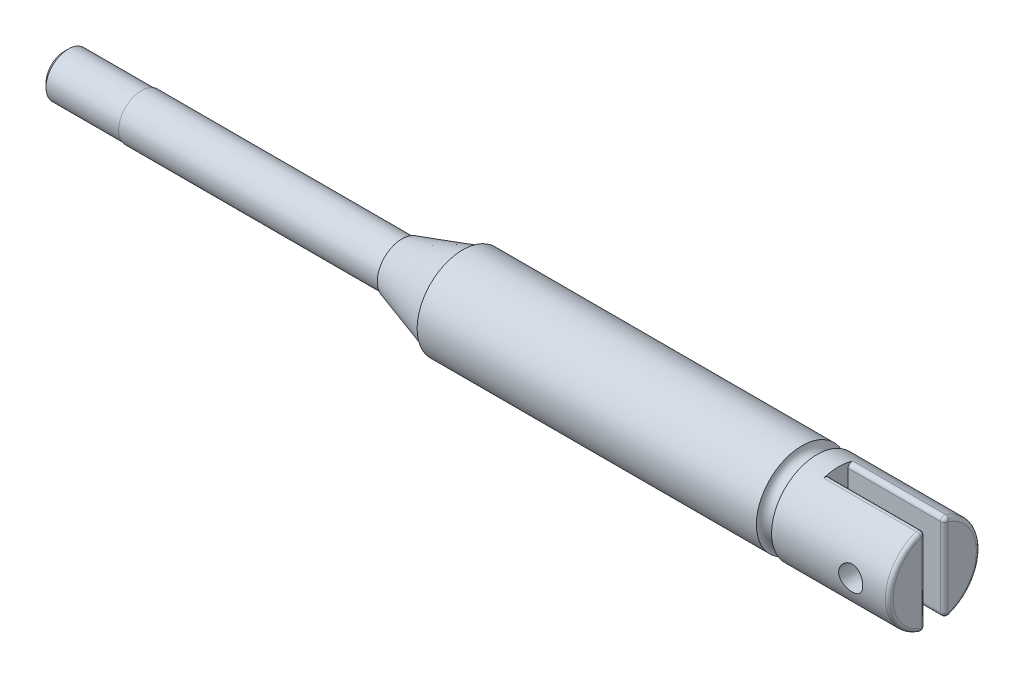
ISO-10303-21;
HEADER;
FILE_DESCRIPTION(('STEP AP214'),'2;1');
FILE_NAME('part.step','',(''),(''),'','','');
FILE_SCHEMA(('AUTOMOTIVE_DESIGN { 1 0 10303 214 1 1 1 1 }'));
ENDSEC;
DATA;
#1=APPLICATION_CONTEXT('core data for automotive mechanical design processes');
#2=APPLICATION_PROTOCOL_DEFINITION('international standard','automotive_design',2000,#1);
#3=PRODUCT_CONTEXT('',#1,'mechanical');
#4=PRODUCT('Part','Part','',(#3));
#5=PRODUCT_RELATED_PRODUCT_CATEGORY('part','',(#4));
#6=PRODUCT_DEFINITION_FORMATION('','',#4);
#7=PRODUCT_DEFINITION_CONTEXT('part definition',#1,'design');
#8=PRODUCT_DEFINITION('design','',#6,#7);
#9=PRODUCT_DEFINITION_SHAPE('','',#8);
#10=(LENGTH_UNIT() NAMED_UNIT(*) SI_UNIT(.MILLI.,.METRE.));
#11=(NAMED_UNIT(*) PLANE_ANGLE_UNIT() SI_UNIT($,.RADIAN.));
#12=(NAMED_UNIT(*) SI_UNIT($,.STERADIAN.) SOLID_ANGLE_UNIT());
#13=UNCERTAINTY_MEASURE_WITH_UNIT(LENGTH_MEASURE(1.E-05),#10,'distance_accuracy_value','');
#14=(GEOMETRIC_REPRESENTATION_CONTEXT(3) GLOBAL_UNCERTAINTY_ASSIGNED_CONTEXT((#13)) GLOBAL_UNIT_ASSIGNED_CONTEXT((#10,
#11,#12)) REPRESENTATION_CONTEXT('',''));
#15=CARTESIAN_POINT('',(0.,0.,0.));
#16=DIRECTION('',(0.,0.,1.));
#17=DIRECTION('',(1.,0.,0.));
#18=AXIS2_PLACEMENT_3D('',#15,#16,#17);
#19=CARTESIAN_POINT('',(-76.0312923411787,0.,0.));
#20=DIRECTION('',(-1.,0.,0.));
#21=DIRECTION('',(0.,-1.,0.));
#22=AXIS2_PLACEMENT_3D('',#19,#20,#21);
#23=CYLINDRICAL_SURFACE('',#22,1.49999999999999);
#24=CARTESIAN_POINT('',(-52.28844,0.,0.));
#25=DIRECTION('',(-1.,0.,0.));
#26=DIRECTION('',(0.,-1.,0.));
#27=AXIS2_PLACEMENT_3D('',#24,#25,#26);
#28=CIRCLE('',#27,1.50000000000001);
#29=CARTESIAN_POINT('',(-52.28844,-1.50000000000001,0.));
#30=VERTEX_POINT('',#29);
#31=EDGE_CURVE('E326',#30,#30,#28,.T.);
#32=ORIENTED_EDGE('',*,*,#31,.F.);
#33=EDGE_LOOP('',(#32));
#34=FACE_BOUND('',#33,.T.);
#35=CARTESIAN_POINT('',(-35.114992,0.,0.));
#36=DIRECTION('',(-1.,0.,0.));
#37=DIRECTION('',(0.,-1.,0.));
#38=AXIS2_PLACEMENT_3D('',#35,#36,#37);
#39=CIRCLE('',#38,1.49999999999999);
#40=CARTESIAN_POINT('',(-35.114992,-1.49999999999998,0.));
#41=VERTEX_POINT('',#40);
#42=EDGE_CURVE('E319',#41,#41,#39,.T.);
#43=ORIENTED_EDGE('',*,*,#42,.T.);
#44=EDGE_LOOP('',(#43));
#45=FACE_BOUND('',#44,.T.);
#46=ADVANCED_FACE('F36',(#34,#45),#23,.T.);
#47=CARTESIAN_POINT('',(-35.114992,1.627,0.));
#48=DIRECTION('',(1.,0.,0.));
#49=DIRECTION('',(0.,1.,0.));
#50=AXIS2_PLACEMENT_3D('',#47,#48,#49);
#51=PLANE('',#50);
#52=ORIENTED_EDGE('',*,*,#42,.F.);
#53=EDGE_LOOP('',(#52));
#54=FACE_BOUND('',#53,.T.);
#55=CARTESIAN_POINT('',(-35.114992,0.,0.));
#56=DIRECTION('',(-1.,0.,0.));
#57=DIRECTION('',(0.,-1.,0.));
#58=AXIS2_PLACEMENT_3D('',#55,#56,#57);
#59=CIRCLE('',#58,1.62699999999999);
#60=CARTESIAN_POINT('',(-35.114992,-1.62699999999998,0.));
#61=VERTEX_POINT('',#60);
#62=EDGE_CURVE('E566',#61,#61,#59,.T.);
#63=ORIENTED_EDGE('',*,*,#62,.T.);
#64=EDGE_LOOP('',(#63));
#65=FACE_BOUND('',#64,.T.);
#66=ADVANCED_FACE('F234',(#54,#65),#51,.F.);
#67=CARTESIAN_POINT('',(-31.115,0.,0.));
#68=DIRECTION('',(1.,0.,0.));
#69=DIRECTION('',(0.,1.,0.));
#70=AXIS2_PLACEMENT_3D('',#67,#68,#69);
#71=CONICAL_SURFACE('',#70,2.87299999999999,0.301974145053179);
#72=ORIENTED_EDGE('',*,*,#62,.F.);
#73=EDGE_LOOP('',(#72));
#74=FACE_BOUND('',#73,.T.);
#75=CARTESIAN_POINT('',(-31.115,0.,0.));
#76=DIRECTION('',(-1.,0.,0.));
#77=DIRECTION('',(0.,-1.,0.));
#78=AXIS2_PLACEMENT_3D('',#75,#76,#77);
#79=CIRCLE('',#78,2.87299999999999);
#80=CARTESIAN_POINT('',(-31.115,-2.87299999999998,0.));
#81=VERTEX_POINT('',#80);
#82=EDGE_CURVE('E561',#81,#81,#79,.T.);
#83=ORIENTED_EDGE('',*,*,#82,.T.);
#84=EDGE_LOOP('',(#83));
#85=FACE_BOUND('',#84,.T.);
#86=ADVANCED_FACE('F240',(#74,#85),#71,.T.);
#87=CARTESIAN_POINT('',(-31.115,3.,0.));
#88=DIRECTION('',(1.,0.,0.));
#89=DIRECTION('',(0.,1.,0.));
#90=AXIS2_PLACEMENT_3D('',#87,#88,#89);
#91=PLANE('',#90);
#92=ORIENTED_EDGE('',*,*,#82,.F.);
#93=EDGE_LOOP('',(#92));
#94=FACE_BOUND('',#93,.T.);
#95=CARTESIAN_POINT('',(-31.115,0.,0.));
#96=DIRECTION('',(-1.,0.,0.));
#97=DIRECTION('',(0.,-1.,0.));
#98=AXIS2_PLACEMENT_3D('',#95,#96,#97);
#99=CIRCLE('',#98,2.99999999999999);
#100=CARTESIAN_POINT('',(-31.115,-2.99999999999998,0.));
#101=VERTEX_POINT('',#100);
#102=EDGE_CURVE('E307',#101,#101,#99,.T.);
#103=ORIENTED_EDGE('',*,*,#102,.T.);
#104=EDGE_LOOP('',(#103));
#105=FACE_BOUND('',#104,.T.);
#106=ADVANCED_FACE('F459',(#94,#105),#91,.F.);
#107=CARTESIAN_POINT('',(-76.0312923411787,0.,0.));
#108=DIRECTION('',(-1.,0.,0.));
#109=DIRECTION('',(0.,-1.,0.));
#110=AXIS2_PLACEMENT_3D('',#107,#108,#109);
#111=CYLINDRICAL_SURFACE('',#110,2.99999999999999);
#112=CARTESIAN_POINT('',(-8.755,0.,0.));
#113=DIRECTION('',(1.,0.,0.));
#114=DIRECTION('',(0.,1.,0.));
#115=AXIS2_PLACEMENT_3D('',#112,#113,#114);
#116=CIRCLE('',#115,2.99999999999999);
#117=CARTESIAN_POINT('',(-8.755,3.,0.));
#118=VERTEX_POINT('',#117);
#119=EDGE_CURVE('E208',#118,#118,#116,.F.);
#120=ORIENTED_EDGE('',*,*,#119,.T.);
#121=EDGE_LOOP('',(#120));
#122=FACE_BOUND('',#121,.T.);
#123=ORIENTED_EDGE('',*,*,#102,.F.);
#124=EDGE_LOOP('',(#123));
#125=FACE_BOUND('',#124,.T.);
#126=ADVANCED_FACE('F335',(#122,#125),#111,.T.);
#127=CARTESIAN_POINT('',(-63.4330682425012,0.,0.));
#128=DIRECTION('',(-1.,0.,0.));
#129=DIRECTION('',(0.,-1.,0.));
#130=AXIS2_PLACEMENT_3D('',#127,#128,#129);
#131=CYLINDRICAL_SURFACE('',#130,1.4605);
#132=CARTESIAN_POINT('',(-57.11444,0.,0.));
#133=DIRECTION('',(1.,0.,0.));
#134=DIRECTION('',(0.,1.,0.));
#135=AXIS2_PLACEMENT_3D('',#132,#133,#134);
#136=CIRCLE('',#135,1.4605);
#137=CARTESIAN_POINT('',(-57.11444,1.4605,0.));
#138=VERTEX_POINT('',#137);
#139=EDGE_CURVE('E147',#138,#138,#136,.T.);
#140=ORIENTED_EDGE('',*,*,#139,.T.);
#141=EDGE_LOOP('',(#140));
#142=FACE_BOUND('',#141,.T.);
#143=CARTESIAN_POINT('',(-52.28844,0.,0.));
#144=DIRECTION('',(-1.,0.,0.));
#145=DIRECTION('',(0.,-1.,0.));
#146=AXIS2_PLACEMENT_3D('',#143,#144,#145);
#147=CIRCLE('',#146,1.4605);
#148=CARTESIAN_POINT('',(-52.28844,-1.4605,0.));
#149=VERTEX_POINT('',#148);
#150=EDGE_CURVE('E195',#149,#149,#147,.T.);
#151=ORIENTED_EDGE('',*,*,#150,.T.);
#152=EDGE_LOOP('',(#151));
#153=FACE_BOUND('',#152,.T.);
#154=ADVANCED_FACE('F330',(#142,#153),#131,.T.);
#155=CARTESIAN_POINT('',(-52.28844,1.50000000000001,0.));
#156=DIRECTION('',(1.,0.,0.));
#157=DIRECTION('',(0.,1.,0.));
#158=AXIS2_PLACEMENT_3D('',#155,#156,#157);
#159=PLANE('',#158);
#160=ORIENTED_EDGE('',*,*,#150,.F.);
#161=EDGE_LOOP('',(#160));
#162=FACE_BOUND('',#161,.T.);
#163=ORIENTED_EDGE('',*,*,#31,.T.);
#164=EDGE_LOOP('',(#163));
#165=FACE_BOUND('',#164,.T.);
#166=ADVANCED_FACE('F248',(#162,#165),#159,.F.);
#167=CARTESIAN_POINT('',(-57.36844,0.,0.));
#168=DIRECTION('',(1.,0.,0.));
#169=DIRECTION('',(0.,1.,0.));
#170=AXIS2_PLACEMENT_3D('',#167,#168,#169);
#171=PLANE('',#170);
#172=CARTESIAN_POINT('',(-57.36844,0.,0.));
#173=DIRECTION('',(1.,0.,0.));
#174=DIRECTION('',(0.,1.,0.));
#175=AXIS2_PLACEMENT_3D('',#172,#173,#174);
#176=CIRCLE('',#175,1.20649999999999);
#177=CARTESIAN_POINT('',(-57.36844,1.20649999999999,0.));
#178=VERTEX_POINT('',#177);
#179=EDGE_CURVE('E314',#178,#178,#176,.F.);
#180=ORIENTED_EDGE('',*,*,#179,.T.);
#181=EDGE_LOOP('',(#180));
#182=FACE_BOUND('',#181,.T.);
#183=ADVANCED_FACE('F229',(#182),#171,.F.);
#184=CARTESIAN_POINT('',(-57.36844,0.,0.));
#185=DIRECTION('',(1.,0.,0.));
#186=DIRECTION('',(0.,1.,0.));
#187=AXIS2_PLACEMENT_3D('',#184,#185,#186);
#188=CONICAL_SURFACE('',#187,1.20649999999999,0.785398163397466);
#189=ORIENTED_EDGE('',*,*,#139,.F.);
#190=EDGE_LOOP('',(#189));
#191=FACE_BOUND('',#190,.T.);
#192=ORIENTED_EDGE('',*,*,#179,.F.);
#193=EDGE_LOOP('',(#192));
#194=FACE_BOUND('',#193,.T.);
#195=ADVANCED_FACE('F221',(#191,#194),#188,.T.);
#196=CARTESIAN_POINT('',(-8.255,0.,0.));
#197=DIRECTION('',(1.,0.,0.));
#198=DIRECTION('',(0.,1.,0.));
#199=AXIS2_PLACEMENT_3D('',#196,#197,#198);
#200=TOROIDAL_SURFACE('',#199,2.99999999999999,0.500000000000001);
#201=ORIENTED_EDGE('',*,*,#119,.F.);
#202=EDGE_LOOP('',(#201));
#203=FACE_BOUND('',#202,.T.);
#204=CARTESIAN_POINT('',(-7.755,0.,0.));
#205=DIRECTION('',(-1.,0.,0.));
#206=DIRECTION('',(0.,-1.,0.));
#207=AXIS2_PLACEMENT_3D('',#204,#205,#206);
#208=CIRCLE('',#207,2.99999999999999);
#209=CARTESIAN_POINT('',(-7.755,-2.99999999999997,0.));
#210=VERTEX_POINT('',#209);
#211=EDGE_CURVE('E40',#210,#210,#208,.F.);
#212=ORIENTED_EDGE('',*,*,#211,.F.);
#213=EDGE_LOOP('',(#212));
#214=FACE_BOUND('',#213,.T.);
#215=ADVANCED_FACE('F218',(#203,#214),#200,.F.);
#216=CARTESIAN_POINT('',(-0.254,0.,0.889));
#217=DIRECTION('',(0.,1.,0.));
#218=DIRECTION('',(-1.,0.,0.));
#219=AXIS2_PLACEMENT_3D('',#216,#217,#218);
#220=CYLINDRICAL_SURFACE('',#219,0.254);
#221=CARTESIAN_POINT('',(-0.253999999999999,-2.59811373884976,0.889));
#222=DIRECTION('',(0.,-1.,0.));
#223=DIRECTION('',(1.,0.,0.));
#224=AXIS2_PLACEMENT_3D('',#221,#222,#223);
#225=CIRCLE('',#224,0.254);
#226=CARTESIAN_POINT('',(0.,-2.59811373884976,0.889));
#227=VERTEX_POINT('',#226);
#228=CARTESIAN_POINT('',(-0.253999999999999,-2.59811373884976,0.635));
#229=VERTEX_POINT('',#228);
#230=EDGE_CURVE('E53',#227,#229,#225,.F.);
#231=ORIENTED_EDGE('',*,*,#230,.T.);
#232=DIRECTION('',(0.,1.,0.));
#233=VECTOR('',#232,1.);
#234=CARTESIAN_POINT('',(-0.253999999999999,-2.99999999999998,0.635));
#235=LINE('',#234,#233);
#236=CARTESIAN_POINT('',(-0.254,2.59811373884978,0.635));
#237=VERTEX_POINT('',#236);
#238=EDGE_CURVE('E178',#237,#229,#235,.F.);
#239=ORIENTED_EDGE('',*,*,#238,.F.);
#240=CARTESIAN_POINT('',(-0.254,2.59811373884978,0.889));
#241=DIRECTION('',(0.,1.,0.));
#242=DIRECTION('',(0.,0.,1.));
#243=AXIS2_PLACEMENT_3D('',#240,#241,#242);
#244=CIRCLE('',#243,0.254);
#245=CARTESIAN_POINT('',(0.,2.59811373884978,0.889));
#246=VERTEX_POINT('',#245);
#247=EDGE_CURVE('E196',#237,#246,#244,.F.);
#248=ORIENTED_EDGE('',*,*,#247,.T.);
#249=DIRECTION('',(0.,1.,0.));
#250=VECTOR('',#249,1.);
#251=CARTESIAN_POINT('',(0.,0.,0.889));
#252=LINE('',#251,#250);
#253=EDGE_CURVE('E174',#227,#246,#252,.T.);
#254=ORIENTED_EDGE('',*,*,#253,.F.);
#255=EDGE_LOOP('',(#231,#239,#248,#254));
#256=FACE_BOUND('',#255,.T.);
#257=ADVANCED_FACE('F220',(#256),#220,.T.);
#258=CARTESIAN_POINT('',(-0.254,0.,-0.889));
#259=DIRECTION('',(0.,-1.,0.));
#260=DIRECTION('',(1.,0.,0.));
#261=AXIS2_PLACEMENT_3D('',#258,#259,#260);
#262=CYLINDRICAL_SURFACE('',#261,0.254);
#263=CARTESIAN_POINT('',(-0.254,2.59811373884978,-0.889));
#264=DIRECTION('',(0.,1.,0.));
#265=DIRECTION('',(-1.,0.,0.));
#266=AXIS2_PLACEMENT_3D('',#263,#264,#265);
#267=CIRCLE('',#266,0.254);
#268=CARTESIAN_POINT('',(0.,2.59811373884978,-0.889));
#269=VERTEX_POINT('',#268);
#270=CARTESIAN_POINT('',(-0.254,2.59811373884978,-0.635));
#271=VERTEX_POINT('',#270);
#272=EDGE_CURVE('E128',#269,#271,#267,.F.);
#273=ORIENTED_EDGE('',*,*,#272,.T.);
#274=DIRECTION('',(0.,-1.,0.));
#275=VECTOR('',#274,1.);
#276=CARTESIAN_POINT('',(-0.253999999999999,-2.99999999999998,-0.635));
#277=LINE('',#276,#275);
#278=CARTESIAN_POINT('',(-0.253999999999999,-2.59811373884976,-0.635));
#279=VERTEX_POINT('',#278);
#280=EDGE_CURVE('E125',#279,#271,#277,.F.);
#281=ORIENTED_EDGE('',*,*,#280,.F.);
#282=CARTESIAN_POINT('',(-0.253999999999999,-2.59811373884976,-0.889));
#283=DIRECTION('',(0.,-1.,0.));
#284=DIRECTION('',(0.,0.,-1.));
#285=AXIS2_PLACEMENT_3D('',#282,#283,#284);
#286=CIRCLE('',#285,0.254);
#287=CARTESIAN_POINT('',(0.,-2.59811373884976,-0.889));
#288=VERTEX_POINT('',#287);
#289=EDGE_CURVE('E119',#279,#288,#286,.F.);
#290=ORIENTED_EDGE('',*,*,#289,.T.);
#291=DIRECTION('',(0.,-1.,0.));
#292=VECTOR('',#291,1.);
#293=CARTESIAN_POINT('',(0.,0.,-0.889));
#294=LINE('',#293,#292);
#295=EDGE_CURVE('E123',#269,#288,#294,.T.);
#296=ORIENTED_EDGE('',*,*,#295,.F.);
#297=EDGE_LOOP('',(#273,#281,#290,#296));
#298=FACE_BOUND('',#297,.T.);
#299=ADVANCED_FACE('F121',(#298),#262,.T.);
#300=CARTESIAN_POINT('',(0.,0.,0.));
#301=DIRECTION('',(-1.,0.,0.));
#302=DIRECTION('',(0.,-1.,0.));
#303=AXIS2_PLACEMENT_3D('',#300,#301,#302);
#304=PLANE('',#303);
#305=CARTESIAN_POINT('',(0.,0.,0.));
#306=DIRECTION('',(-1.,0.,0.));
#307=DIRECTION('',(0.,-1.,0.));
#308=AXIS2_PLACEMENT_3D('',#305,#306,#307);
#309=CIRCLE('',#308,2.74599999999999);
#310=EDGE_CURVE('E142',#288,#269,#309,.F.);
#311=ORIENTED_EDGE('',*,*,#310,.T.);
#312=ORIENTED_EDGE('',*,*,#295,.T.);
#313=EDGE_LOOP('',(#311,#312));
#314=FACE_BOUND('',#313,.T.);
#315=ADVANCED_FACE('F149',(#314),#304,.F.);
#316=CARTESIAN_POINT('',(-0.254,2.59811373884978,-0.889));
#317=DIRECTION('',(0.,0.,1.));
#318=DIRECTION('',(1.,0.,0.));
#319=AXIS2_PLACEMENT_3D('',#316,#317,#318);
#320=SPHERICAL_SURFACE('',#319,0.254);
#321=CARTESIAN_POINT('',(-0.254,2.59811373884978,-0.889));
#322=DIRECTION('',(0.,0.323743627093956,0.946144842989724));
#323=DIRECTION('',(0.,-0.946144842989724,0.323743627093956));
#324=AXIS2_PLACEMENT_3D('',#321,#322,#323);
#325=CIRCLE('',#324,0.254);
#326=CARTESIAN_POINT('',(-0.254000000000005,2.83843452896917,-0.971230881281865));
#327=VERTEX_POINT('',#326);
#328=EDGE_CURVE('E139',#269,#327,#325,.T.);
#329=ORIENTED_EDGE('',*,*,#328,.T.);
#330=CARTESIAN_POINT('',(-0.254000000000005,2.59811373884978,-0.889));
#331=DIRECTION('',(1.,0.,0.));
#332=DIRECTION('',(0.,0.,-1.));
#333=AXIS2_PLACEMENT_3D('',#330,#331,#332);
#334=CIRCLE('',#333,0.254);
#335=EDGE_CURVE('E192',#327,#271,#334,.T.);
#336=ORIENTED_EDGE('',*,*,#335,.T.);
#337=ORIENTED_EDGE('',*,*,#272,.F.);
#338=EDGE_LOOP('',(#329,#336,#337));
#339=FACE_BOUND('',#338,.T.);
#340=ADVANCED_FACE('F257',(#339),#320,.T.);
#341=CARTESIAN_POINT('',(0.,0.,0.));
#342=DIRECTION('',(-1.,0.,0.));
#343=DIRECTION('',(0.,-1.,0.));
#344=AXIS2_PLACEMENT_3D('',#341,#342,#343);
#345=CIRCLE('',#344,2.74599999999999);
#346=EDGE_CURVE('E172',#246,#227,#345,.F.);
#347=ORIENTED_EDGE('',*,*,#346,.T.);
#348=ORIENTED_EDGE('',*,*,#253,.T.);
#349=EDGE_LOOP('',(#347,#348));
#350=FACE_BOUND('',#349,.T.);
#351=ADVANCED_FACE('F260',(#350),#304,.F.);
#352=CARTESIAN_POINT('',(-0.254,2.59811373884978,0.889));
#353=DIRECTION('',(0.,0.,1.));
#354=DIRECTION('',(1.,0.,0.));
#355=AXIS2_PLACEMENT_3D('',#352,#353,#354);
#356=SPHERICAL_SURFACE('',#355,0.254);
#357=CARTESIAN_POINT('',(-0.254,2.59811373884978,0.889));
#358=DIRECTION('',(1.,0.,0.));
#359=DIRECTION('',(0.,1.,0.));
#360=AXIS2_PLACEMENT_3D('',#357,#358,#359);
#361=CIRCLE('',#360,0.254);
#362=CARTESIAN_POINT('',(-0.254000000000005,2.83843452896917,0.971230881281865));
#363=VERTEX_POINT('',#362);
#364=EDGE_CURVE('E199',#237,#363,#361,.T.);
#365=ORIENTED_EDGE('',*,*,#364,.T.);
#366=CARTESIAN_POINT('',(-0.254000000000005,2.59811373884978,0.889));
#367=DIRECTION('',(0.,0.323743627093956,-0.946144842989724));
#368=DIRECTION('',(0.,0.946144842989724,0.323743627093956));
#369=AXIS2_PLACEMENT_3D('',#366,#367,#368);
#370=CIRCLE('',#369,0.254);
#371=EDGE_CURVE('E202',#363,#246,#370,.T.);
#372=ORIENTED_EDGE('',*,*,#371,.T.);
#373=ORIENTED_EDGE('',*,*,#247,.F.);
#374=EDGE_LOOP('',(#365,#372,#373));
#375=FACE_BOUND('',#374,.T.);
#376=ADVANCED_FACE('F275',(#375),#356,.T.);
#377=CARTESIAN_POINT('',(-0.253999999999999,-2.59811373884976,0.889));
#378=DIRECTION('',(0.,0.,1.));
#379=DIRECTION('',(1.,0.,0.));
#380=AXIS2_PLACEMENT_3D('',#377,#378,#379);
#381=SPHERICAL_SURFACE('',#380,0.254);
#382=CARTESIAN_POINT('',(-0.253999999999999,-2.59811373884976,0.889));
#383=DIRECTION('',(0.,-0.323743627093956,-0.946144842989724));
#384=DIRECTION('',(0.,0.946144842989724,-0.323743627093956));
#385=AXIS2_PLACEMENT_3D('',#382,#383,#384);
#386=CIRCLE('',#385,0.254);
#387=CARTESIAN_POINT('',(-0.254000000000004,-2.83843452896915,0.971230881281865));
#388=VERTEX_POINT('',#387);
#389=EDGE_CURVE('E205',#227,#388,#386,.T.);
#390=ORIENTED_EDGE('',*,*,#389,.T.);
#391=CARTESIAN_POINT('',(-0.254000000000004,-2.59811373884976,0.889));
#392=DIRECTION('',(1.,0.,0.));
#393=DIRECTION('',(0.,0.,-1.));
#394=AXIS2_PLACEMENT_3D('',#391,#392,#393);
#395=CIRCLE('',#394,0.254);
#396=EDGE_CURVE('E129',#388,#229,#395,.T.);
#397=ORIENTED_EDGE('',*,*,#396,.T.);
#398=ORIENTED_EDGE('',*,*,#230,.F.);
#399=EDGE_LOOP('',(#390,#397,#398));
#400=FACE_BOUND('',#399,.T.);
#401=ADVANCED_FACE('F278',(#400),#381,.T.);
#402=CARTESIAN_POINT('',(-6.35,-2.99999999999998,0.635));
#403=DIRECTION('',(0.,0.,1.));
#404=DIRECTION('',(1.,0.,0.));
#405=AXIS2_PLACEMENT_3D('',#402,#403,#404);
#406=PLANE('',#405);
#407=CARTESIAN_POINT('',(-2.54,0.,0.635));
#408=DIRECTION('',(0.,0.,1.));
#409=DIRECTION('',(1.,0.,0.));
#410=AXIS2_PLACEMENT_3D('',#407,#408,#409);
#411=CIRCLE('',#410,0.79375);
#412=CARTESIAN_POINT('',(-1.74625,0.,0.635));
#413=VERTEX_POINT('',#412);
#414=EDGE_CURVE('E325',#413,#413,#411,.T.);
#415=ORIENTED_EDGE('',*,*,#414,.T.);
#416=EDGE_LOOP('',(#415));
#417=FACE_BOUND('',#416,.T.);
#418=ORIENTED_EDGE('',*,*,#238,.T.);
#419=DIRECTION('',(-1.,0.,0.));
#420=VECTOR('',#419,1.);
#421=CARTESIAN_POINT('',(-6.35,-2.59811373884976,0.635));
#422=LINE('',#421,#420);
#423=CARTESIAN_POINT('',(-6.35,-2.59811373884976,0.635));
#424=VERTEX_POINT('',#423);
#425=EDGE_CURVE('E180',#229,#424,#422,.T.);
#426=ORIENTED_EDGE('',*,*,#425,.T.);
#427=DIRECTION('',(0.,1.,0.));
#428=VECTOR('',#427,1.);
#429=CARTESIAN_POINT('',(-6.35,-2.99999999999998,0.635));
#430=LINE('',#429,#428);
#431=CARTESIAN_POINT('',(-6.35,2.59811373884978,0.635));
#432=VERTEX_POINT('',#431);
#433=EDGE_CURVE('E303',#424,#432,#430,.T.);
#434=ORIENTED_EDGE('',*,*,#433,.T.);
#435=DIRECTION('',(-1.,0.,0.));
#436=VECTOR('',#435,1.);
#437=CARTESIAN_POINT('',(-6.35,2.59811373884978,0.635));
#438=LINE('',#437,#436);
#439=EDGE_CURVE('E61',#432,#237,#438,.F.);
#440=ORIENTED_EDGE('',*,*,#439,.T.);
#441=EDGE_LOOP('',(#418,#426,#434,#440));
#442=FACE_BOUND('',#441,.T.);
#443=ADVANCED_FACE('F282',(#417,#442),#406,.F.);
#444=CARTESIAN_POINT('',(-6.35,-2.99999999999998,-0.635));
#445=DIRECTION('',(0.,0.,-1.));
#446=DIRECTION('',(-1.,0.,0.));
#447=AXIS2_PLACEMENT_3D('',#444,#445,#446);
#448=PLANE('',#447);
#449=CARTESIAN_POINT('',(-2.54,0.,-0.635));
#450=DIRECTION('',(0.,0.,-1.));
#451=DIRECTION('',(-1.,0.,0.));
#452=AXIS2_PLACEMENT_3D('',#449,#450,#451);
#453=CIRCLE('',#452,0.79375);
#454=CARTESIAN_POINT('',(-3.33375,0.,-0.635));
#455=VERTEX_POINT('',#454);
#456=EDGE_CURVE('E323',#455,#455,#453,.T.);
#457=ORIENTED_EDGE('',*,*,#456,.T.);
#458=EDGE_LOOP('',(#457));
#459=FACE_BOUND('',#458,.T.);
#460=DIRECTION('',(0.,1.,0.));
#461=VECTOR('',#460,1.);
#462=CARTESIAN_POINT('',(-6.35,-2.99999999999998,-0.635));
#463=LINE('',#462,#461);
#464=CARTESIAN_POINT('',(-6.35,-2.59811373884976,-0.635));
#465=VERTEX_POINT('',#464);
#466=CARTESIAN_POINT('',(-6.35,2.59811373884978,-0.635));
#467=VERTEX_POINT('',#466);
#468=EDGE_CURVE('E308',#465,#467,#463,.T.);
#469=ORIENTED_EDGE('',*,*,#468,.F.);
#470=DIRECTION('',(-1.,0.,0.));
#471=VECTOR('',#470,1.);
#472=CARTESIAN_POINT('',(-6.35,-2.59811373884976,-0.635));
#473=LINE('',#472,#471);
#474=EDGE_CURVE('E156',#465,#279,#473,.F.);
#475=ORIENTED_EDGE('',*,*,#474,.T.);
#476=ORIENTED_EDGE('',*,*,#280,.T.);
#477=DIRECTION('',(-1.,0.,0.));
#478=VECTOR('',#477,1.);
#479=CARTESIAN_POINT('',(-6.35,2.59811373884978,-0.635));
#480=LINE('',#479,#478);
#481=EDGE_CURVE('E150',#271,#467,#480,.T.);
#482=ORIENTED_EDGE('',*,*,#481,.T.);
#483=EDGE_LOOP('',(#469,#475,#476,#482));
#484=FACE_BOUND('',#483,.T.);
#485=ADVANCED_FACE('F256',(#459,#484),#448,.F.);
#486=CARTESIAN_POINT('',(-0.253999999999999,-2.59811373884976,-0.889));
#487=DIRECTION('',(0.,0.,1.));
#488=DIRECTION('',(1.,0.,0.));
#489=AXIS2_PLACEMENT_3D('',#486,#487,#488);
#490=SPHERICAL_SURFACE('',#489,0.254);
#491=CARTESIAN_POINT('',(-0.253999999999999,-2.59811373884976,-0.889));
#492=DIRECTION('',(1.,0.,0.));
#493=DIRECTION('',(0.,1.,0.));
#494=AXIS2_PLACEMENT_3D('',#491,#492,#493);
#495=CIRCLE('',#494,0.254);
#496=CARTESIAN_POINT('',(-0.254000000000004,-2.83843452896915,-0.971230881281865));
#497=VERTEX_POINT('',#496);
#498=EDGE_CURVE('E136',#279,#497,#495,.T.);
#499=ORIENTED_EDGE('',*,*,#498,.T.);
#500=CARTESIAN_POINT('',(-0.254000000000004,-2.59811373884976,-0.889));
#501=DIRECTION('',(0.,-0.323743627093957,0.946144842989724));
#502=DIRECTION('',(0.,-0.946144842989724,-0.323743627093957));
#503=AXIS2_PLACEMENT_3D('',#500,#501,#502);
#504=CIRCLE('',#503,0.254);
#505=EDGE_CURVE('E132',#497,#288,#504,.T.);
#506=ORIENTED_EDGE('',*,*,#505,.T.);
#507=ORIENTED_EDGE('',*,*,#289,.F.);
#508=EDGE_LOOP('',(#499,#506,#507));
#509=FACE_BOUND('',#508,.T.);
#510=ADVANCED_FACE('F134',(#509),#490,.T.);
#511=CARTESIAN_POINT('',(-2.54,0.,-2.99999999999999));
#512=DIRECTION('',(0.,0.,1.));
#513=DIRECTION('',(1.,0.,0.));
#514=AXIS2_PLACEMENT_3D('',#511,#512,#513);
#515=CYLINDRICAL_SURFACE('',#514,0.79375);
#516=ORIENTED_EDGE('',*,*,#456,.F.);
#517=EDGE_LOOP('',(#516));
#518=FACE_BOUND('',#517,.T.);
#519=CARTESIAN_POINT('',(-1.74625,0.,-2.99999999999999));
#520=CARTESIAN_POINT('',(-1.74625106466458,0.0437698375668157,-2.9999993282264));
#521=CARTESIAN_POINT('',(-1.74988254999377,0.0875511439939445,-2.99903265897856));
#522=CARTESIAN_POINT('',(-1.76428734018329,0.17385336792853,-2.9952702766813));
#523=CARTESIAN_POINT('',(-1.7750641600128,0.216373654348215,-2.99247366344542));
#524=CARTESIAN_POINT('',(-1.80338534416475,0.298895558183938,-2.98536019494753));
#525=CARTESIAN_POINT('',(-1.82092105910498,0.338900318931544,-2.9810452832695));
#526=CARTESIAN_POINT('',(-1.86223040276898,0.415400954854202,-2.97135167835241));
#527=CARTESIAN_POINT('',(-1.88600442136328,0.45189661052852,-2.96597291863203));
#528=CARTESIAN_POINT('',(-1.93968923528594,0.521177198313556,-2.95459529167835));
#529=CARTESIAN_POINT('',(-1.96971606590674,0.553870498840004,-2.948585955456));
#530=CARTESIAN_POINT('',(-2.03480605532623,0.613821062476154,-2.93669198347927));
#531=CARTESIAN_POINT('',(-2.06986985088904,0.641077637242554,-2.93080736359941));
#532=CARTESIAN_POINT('',(-2.14476729320822,0.689825783926276,-2.91972221312683));
#533=CARTESIAN_POINT('',(-2.1846714436118,0.711212314583401,-2.91453490163149));
#534=CARTESIAN_POINT('',(-2.26766841339288,0.746936853108402,-2.90558545856868));
#535=CARTESIAN_POINT('',(-2.31076065333328,0.761276138213968,-2.90182306877781));
#536=CARTESIAN_POINT('',(-2.39789667894256,0.782181634058109,-2.89625748536585));
#537=CARTESIAN_POINT('',(-2.44189791653429,0.788913803347784,-2.89441253550613));
#538=CARTESIAN_POINT('',(-2.53044095911576,0.794931306686499,-2.89276593751789));
#539=CARTESIAN_POINT('',(-2.57498266329633,0.794218008787497,-2.89296391401602));
#540=CARTESIAN_POINT('',(-2.66204993546567,0.785496664193203,-2.89534340740742));
#541=CARTESIAN_POINT('',(-2.70459730494513,0.777689037954792,-2.89747042426131));
#542=CARTESIAN_POINT('',(-2.78775562385429,0.755321500880883,-2.90338112457289));
#543=CARTESIAN_POINT('',(-2.82836642039022,0.740761057876009,-2.90716493859651));
#544=CARTESIAN_POINT('',(-2.90702314199696,0.705136935568971,-2.91601108429069));
#545=CARTESIAN_POINT('',(-2.94503548852245,0.684002677548692,-2.92108717740622));
#546=CARTESIAN_POINT('',(-3.01704483448691,0.635880102873265,-2.93193848850909));
#547=CARTESIAN_POINT('',(-3.05104105267015,0.608890650096443,-2.93771384208226));
#548=CARTESIAN_POINT('',(-3.11519864441466,0.548797335418491,-2.94954012997449));
#549=CARTESIAN_POINT('',(-3.14520196174313,0.515525063857159,-2.95559396059681));
#550=CARTESIAN_POINT('',(-3.19923505967777,0.444347463545209,-2.96712878584985));
#551=CARTESIAN_POINT('',(-3.22326461205786,0.406441957865631,-2.97260975859004));
#552=CARTESIAN_POINT('',(-3.26473616217239,0.326831593122855,-2.98241416327767));
#553=CARTESIAN_POINT('',(-3.28214993361147,0.285111376395161,-2.98673261299293));
#554=CARTESIAN_POINT('',(-3.30967123600047,0.199195346207609,-2.99368936208497));
#555=CARTESIAN_POINT('',(-3.31978033782868,0.155000067217067,-2.99632802268796));
#556=CARTESIAN_POINT('',(-3.3321580429915,0.0667376523615833,-2.99957341029864));
#557=CARTESIAN_POINT('',(-3.33464158096443,0.0227026605941382,-3.00023582426948));
#558=CARTESIAN_POINT('',(-3.33229070813109,-0.065154514564261,-2.99961399386761));
#559=CARTESIAN_POINT('',(-3.32745704105676,-0.108976719129068,-2.99832994733612));
#560=CARTESIAN_POINT('',(-3.31078538041926,-0.194399831758913,-2.99399540566287));
#561=CARTESIAN_POINT('',(-3.29906693342828,-0.23602574225483,-2.99097507794908));
#562=CARTESIAN_POINT('',(-3.26909688819508,-0.316717136609313,-2.98351028151612));
#563=CARTESIAN_POINT('',(-3.25084458770102,-0.355782344712057,-2.97906565972068));
#564=CARTESIAN_POINT('',(-3.20792399340457,-0.431081141367528,-2.96911443505799));
#565=CARTESIAN_POINT('',(-3.18313832885425,-0.467245269078571,-2.9635889383961));
#566=CARTESIAN_POINT('',(-3.12800244880278,-0.534976580546292,-2.95211485449207));
#567=CARTESIAN_POINT('',(-3.09765115191606,-0.566542868814267,-2.94616618516646));
#568=CARTESIAN_POINT('',(-3.03124314635651,-0.625085613836346,-2.93431188392032));
#569=CARTESIAN_POINT('',(-2.9950515704678,-0.651910529668655,-2.92841201919743));
#570=CARTESIAN_POINT('',(-2.91855627980036,-0.699109160049003,-2.91750500029281));
#571=CARTESIAN_POINT('',(-2.8782527386848,-0.719483146894132,-2.9124978084348));
#572=CARTESIAN_POINT('',(-2.79488111093695,-0.753048198559642,-2.90400040127052));
#573=CARTESIAN_POINT('',(-2.75183079398742,-0.766281053140331,-2.9005013849586));
#574=CARTESIAN_POINT('',(-2.66400796337882,-0.785288661572236,-2.89541367903229));
#575=CARTESIAN_POINT('',(-2.61923588440283,-0.791065285289,-2.89382451047521));
#576=CARTESIAN_POINT('',(-2.53079068680283,-0.794890137295294,-2.89277599719909));
#577=CARTESIAN_POINT('',(-2.48712872977834,-0.793181751627871,-2.893249576234));
#578=CARTESIAN_POINT('',(-2.40073930763013,-0.782648683082195,-2.89611640360626));
#579=CARTESIAN_POINT('',(-2.35801181919211,-0.773824177954277,-2.89850960399424));
#580=CARTESIAN_POINT('',(-2.275005182699,-0.749449449904848,-2.90490641512379));
#581=CARTESIAN_POINT('',(-2.23471010853109,-0.733950041015906,-2.90889784323185));
#582=CARTESIAN_POINT('',(-2.15726201415366,-0.696705015333011,-2.91804184333839));
#583=CARTESIAN_POINT('',(-2.12010948089842,-0.674958432791405,-2.92319459483875));
#584=CARTESIAN_POINT('',(-2.04883749080431,-0.625095478483187,-2.93426733469649));
#585=CARTESIAN_POINT('',(-2.01483725139236,-0.596812658972944,-2.94020524062604));
#586=CARTESIAN_POINT('',(-1.95198634295489,-0.534997634358597,-2.9520783115328));
#587=CARTESIAN_POINT('',(-1.92313692379283,-0.501464158860704,-2.95801347549711));
#588=CARTESIAN_POINT('',(-1.87081279392072,-0.429251570229419,-2.96936104731978));
#589=CARTESIAN_POINT('',(-1.84746340971163,-0.390479337398087,-2.97475989094736));
#590=CARTESIAN_POINT('',(-1.80765096430805,-0.309418659439655,-2.98427885720708));
#591=CARTESIAN_POINT('',(-1.79118341749862,-0.267132526308945,-2.98839981231976));
#592=CARTESIAN_POINT('',(-1.76778827306697,-0.187493841983335,-2.99435591929854));
#593=CARTESIAN_POINT('',(-1.75973001069687,-0.150489373439837,-2.99645714060735));
#594=CARTESIAN_POINT('',(-1.74896066930791,-0.075659407131333,-2.99927940540138));
#595=CARTESIAN_POINT('',(-1.74624907971998,-0.0378339881100275,-3.00000058067095));
#596=CARTESIAN_POINT('',(-1.74625,0.,-2.99999999999999));
#597=B_SPLINE_CURVE_WITH_KNOTS('',3,(#519,#520,#521,#522,#523,#524,#525,#526,#527,#528,#529,
#530,#531,#532,#533,#534,#535,#536,#537,#538,#539,#540,#541,#542,#543,#544,#545,#546,#547,#548,
#549,#550,#551,#552,#553,#554,#555,#556,#557,#558,#559,#560,#561,#562,#563,#564,#565,#566,#567,
#568,#569,#570,#571,#572,#573,#574,#575,#576,#577,#578,#579,#580,#581,#582,#583,#584,#585,#586,
#587,#588,#589,#590,#591,#592,#593,#594,#595,#596),.UNSPECIFIED.,.T.,.F.,(4,2,2,2,2,2,2,2,2,2,2,
2,2,2,2,2,2,2,2,2,2,2,2,2,2,2,2,2,2,2,2,2,2,2,2,2,2,2,4),(0.,0.131170778552684,
0.262406131221829,0.393474096165234,0.524550254315586,0.658319122095874,0.792104915603677,
0.928148246343878,1.06416691158815,1.1971571314056,1.33012291564059,1.45944527739847,
1.58877783239871,1.71954988805291,1.85034734099455,1.98534182002352,2.12034145568787,
2.25591076768455,2.39145091664823,2.52313392623773,2.65480355226297,2.78425176587794,
2.91371389663283,3.04568237466845,3.1776765210025,3.31333069649479,3.44897914518969,
3.58382492836286,3.71863688848134,3.84909835252879,3.97955655793919,4.10903870904436,
4.23854088751621,4.37179895192902,4.50508930803182,4.64117339839338,4.77716864961561,
4.89056152297319,5.00394356759626),.UNSPECIFIED.);
#598=CARTESIAN_POINT('',(-1.74625,0.,-2.99999999999999));
#599=VERTEX_POINT('',#598);
#600=EDGE_CURVE('E354',#599,#599,#597,.T.);
#601=ORIENTED_EDGE('',*,*,#600,.F.);
#602=EDGE_LOOP('',(#601));
#603=FACE_BOUND('',#602,.T.);
#604=ADVANCED_FACE('F255',(#518,#603),#515,.F.);
#605=ORIENTED_EDGE('',*,*,#414,.F.);
#606=EDGE_LOOP('',(#605));
#607=FACE_BOUND('',#606,.T.);
#608=CARTESIAN_POINT('',(-1.74625,0.,2.99999999999999));
#609=CARTESIAN_POINT('',(-1.74625106466458,-0.0437698375668021,2.9999993282264));
#610=CARTESIAN_POINT('',(-1.74988254999377,-0.087551143993931,2.99903265897856));
#611=CARTESIAN_POINT('',(-1.76428734018329,-0.173853367928517,2.9952702766813));
#612=CARTESIAN_POINT('',(-1.77506416001279,-0.216373654348202,2.99247366344542));
#613=CARTESIAN_POINT('',(-1.80338534416474,-0.298895558183926,2.98536019494753));
#614=CARTESIAN_POINT('',(-1.82092105910498,-0.338900318931531,2.98104528326949));
#615=CARTESIAN_POINT('',(-1.86223040276898,-0.415400954854191,2.97135167835241));
#616=CARTESIAN_POINT('',(-1.88600442136327,-0.451896610528509,2.96597291863203));
#617=CARTESIAN_POINT('',(-1.93968923528594,-0.521177198313546,2.95459529167835));
#618=CARTESIAN_POINT('',(-1.96971606590673,-0.553870498839994,2.94858595545599));
#619=CARTESIAN_POINT('',(-2.03480605532622,-0.613821062476145,2.93669198347927));
#620=CARTESIAN_POINT('',(-2.06986985088902,-0.641077637242546,2.93080736359941));
#621=CARTESIAN_POINT('',(-2.1447672932082,-0.689825783926269,2.91972221312683));
#622=CARTESIAN_POINT('',(-2.18467144361178,-0.711212314583395,2.91453490163148));
#623=CARTESIAN_POINT('',(-2.26766841339287,-0.746936853108397,2.90558545856868));
#624=CARTESIAN_POINT('',(-2.31076065333327,-0.761276138213964,2.90182306877781));
#625=CARTESIAN_POINT('',(-2.39789667894254,-0.782181634058106,2.89625748536584));
#626=CARTESIAN_POINT('',(-2.44189791653427,-0.788913803347782,2.89441253550612));
#627=CARTESIAN_POINT('',(-2.53044095911575,-0.794931306686499,2.89276593751788));
#628=CARTESIAN_POINT('',(-2.57498266329631,-0.794218008787498,2.89296391401601));
#629=CARTESIAN_POINT('',(-2.66204993546565,-0.785496664193205,2.89534340740741));
#630=CARTESIAN_POINT('',(-2.70459730494512,-0.777689037954794,2.8974704242613));
#631=CARTESIAN_POINT('',(-2.78775562385428,-0.755321500880887,2.90338112457288));
#632=CARTESIAN_POINT('',(-2.82836642039021,-0.740761057876014,2.90716493859651));
#633=CARTESIAN_POINT('',(-2.90702314199694,-0.705136935568977,2.91601108429068));
#634=CARTESIAN_POINT('',(-2.94503548852244,-0.684002677548699,2.92108717740621));
#635=CARTESIAN_POINT('',(-3.0170448344869,-0.635880102873274,2.93193848850908));
#636=CARTESIAN_POINT('',(-3.05104105267014,-0.608890650096453,2.93771384208226));
#637=CARTESIAN_POINT('',(-3.11519864441465,-0.548797335418502,2.94954012997448));
#638=CARTESIAN_POINT('',(-3.14520196174312,-0.51552506385717,2.9555939605968));
#639=CARTESIAN_POINT('',(-3.19923505967776,-0.444347463545221,2.96712878584984));
#640=CARTESIAN_POINT('',(-3.22326461205786,-0.406441957865644,2.97260975859004));
#641=CARTESIAN_POINT('',(-3.26473616217239,-0.326831593122869,2.98241416327766));
#642=CARTESIAN_POINT('',(-3.28214993361146,-0.285111376395175,2.98673261299293));
#643=CARTESIAN_POINT('',(-3.30967123600047,-0.199195346207623,2.99368936208497));
#644=CARTESIAN_POINT('',(-3.31978033782868,-0.155000067217081,2.99632802268796));
#645=CARTESIAN_POINT('',(-3.3321580429915,-0.0667376523615978,2.99957341029864));
#646=CARTESIAN_POINT('',(-3.33464158096443,-0.0227026605941526,3.00023582426948));
#647=CARTESIAN_POINT('',(-3.33229070813109,0.065154514564247,2.99961399386761));
#648=CARTESIAN_POINT('',(-3.32745704105676,0.108976719129054,2.99832994733612));
#649=CARTESIAN_POINT('',(-3.31078538041926,0.1943998317589,2.99399540566287));
#650=CARTESIAN_POINT('',(-3.29906693342828,0.236025742254817,2.99097507794908));
#651=CARTESIAN_POINT('',(-3.26909688819509,0.316717136609301,2.98351028151612));
#652=CARTESIAN_POINT('',(-3.25084458770103,0.355782344712046,2.97906565972068));
#653=CARTESIAN_POINT('',(-3.20792399340458,0.431081141367517,2.96911443505799));
#654=CARTESIAN_POINT('',(-3.18313832885425,0.467245269078561,2.96358893839611));
#655=CARTESIAN_POINT('',(-3.12800244880279,0.534976580546283,2.95211485449207));
#656=CARTESIAN_POINT('',(-3.09765115191607,0.566542868814258,2.94616618516646));
#657=CARTESIAN_POINT('',(-3.03124314635653,0.625085613836337,2.93431188392033));
#658=CARTESIAN_POINT('',(-2.99505157046782,0.651910529668647,2.92841201919743));
#659=CARTESIAN_POINT('',(-2.91855627980037,0.699109160048995,2.91750500029282));
#660=CARTESIAN_POINT('',(-2.87825273868481,0.719483146894126,2.91249780843481));
#661=CARTESIAN_POINT('',(-2.79488111093697,0.753048198559637,2.90400040127053));
#662=CARTESIAN_POINT('',(-2.75183079398744,0.766281053140328,2.90050138495861));
#663=CARTESIAN_POINT('',(-2.66400796337883,0.785288661572234,2.89541367903229));
#664=CARTESIAN_POINT('',(-2.61923588440284,0.791065285288999,2.89382451047522));
#665=CARTESIAN_POINT('',(-2.53079068680285,0.794890137295294,2.8927759971991));
#666=CARTESIAN_POINT('',(-2.48712872977836,0.793181751627872,2.89324957623401));
#667=CARTESIAN_POINT('',(-2.40073930763014,0.782648683082198,2.89611640360626));
#668=CARTESIAN_POINT('',(-2.35801181919212,0.77382417795428,2.89850960399425));
#669=CARTESIAN_POINT('',(-2.27500518269901,0.749449449904853,2.9049064151238));
#670=CARTESIAN_POINT('',(-2.23471010853111,0.733950041015911,2.90889784323186));
#671=CARTESIAN_POINT('',(-2.15726201415367,0.696705015333018,2.91804184333839));
#672=CARTESIAN_POINT('',(-2.12010948089843,0.674958432791412,2.92319459483876));
#673=CARTESIAN_POINT('',(-2.04883749080432,0.625095478483195,2.9342673346965));
#674=CARTESIAN_POINT('',(-2.01483725139237,0.596812658972953,2.94020524062605));
#675=CARTESIAN_POINT('',(-1.9519863429549,0.534997634358607,2.9520783115328));
#676=CARTESIAN_POINT('',(-1.92313692379283,0.501464158860714,2.95801347549712));
#677=CARTESIAN_POINT('',(-1.87081279392072,0.429251570229429,2.96936104731978));
#678=CARTESIAN_POINT('',(-1.84746340971164,0.390479337398098,2.97475989094737));
#679=CARTESIAN_POINT('',(-1.80765096430806,0.309418659439667,2.98427885720708));
#680=CARTESIAN_POINT('',(-1.79118341749863,0.267132526308957,2.98839981231976));
#681=CARTESIAN_POINT('',(-1.76778827306698,0.187493841983348,2.99435591929854));
#682=CARTESIAN_POINT('',(-1.75973001069687,0.15048937343985,2.99645714060735));
#683=CARTESIAN_POINT('',(-1.74896066930791,0.0756594071313466,2.99927940540138));
#684=CARTESIAN_POINT('',(-1.74624907971998,0.0378339881100412,3.00000058067095));
#685=CARTESIAN_POINT('',(-1.74625,0.,2.99999999999999));
#686=B_SPLINE_CURVE_WITH_KNOTS('',3,(#608,#609,#610,#611,#612,#613,#614,#615,#616,#617,#618,
#619,#620,#621,#622,#623,#624,#625,#626,#627,#628,#629,#630,#631,#632,#633,#634,#635,#636,#637,
#638,#639,#640,#641,#642,#643,#644,#645,#646,#647,#648,#649,#650,#651,#652,#653,#654,#655,#656,
#657,#658,#659,#660,#661,#662,#663,#664,#665,#666,#667,#668,#669,#670,#671,#672,#673,#674,#675,
#676,#677,#678,#679,#680,#681,#682,#683,#684,#685),.UNSPECIFIED.,.T.,.F.,(4,2,2,2,2,2,2,2,2,2,2,
2,2,2,2,2,2,2,2,2,2,2,2,2,2,2,2,2,2,2,2,2,2,2,2,2,2,2,4),(0.,0.131170778552684,
0.262406131221829,0.393474096165234,0.524550254315586,0.658319122095874,0.792104915603678,
0.928148246343878,1.06416691158815,1.1971571314056,1.3301229156406,1.45944527739847,
1.58877783239871,1.71954988805291,1.85034734099455,1.98534182002352,2.12034145568787,
2.25591076768455,2.39145091664823,2.52313392623773,2.65480355226297,2.78425176587794,
2.91371389663283,3.04568237466845,3.1776765210025,3.31333069649478,3.44897914518969,
3.58382492836286,3.71863688848134,3.84909835252879,3.9795565579392,4.10903870904436,
4.23854088751621,4.37179895192902,4.50508930803182,4.64117339839338,4.77716864961561,
4.89056152297319,5.00394356759626),.UNSPECIFIED.);
#687=CARTESIAN_POINT('',(-1.74625,0.,2.99999999999999));
#688=VERTEX_POINT('',#687);
#689=EDGE_CURVE('E346',#688,#688,#686,.T.);
#690=ORIENTED_EDGE('',*,*,#689,.F.);
#691=EDGE_LOOP('',(#690));
#692=FACE_BOUND('',#691,.T.);
#693=ADVANCED_FACE('F270',(#607,#692),#515,.F.);
#694=CARTESIAN_POINT('',(-0.254000000000004,0.,0.));
#695=DIRECTION('',(-1.,0.,0.));
#696=DIRECTION('',(0.,-1.,0.));
#697=AXIS2_PLACEMENT_3D('',#694,#695,#696);
#698=TOROIDAL_SURFACE('',#697,2.74599999999999,0.254);
#699=ORIENTED_EDGE('',*,*,#505,.F.);
#700=CARTESIAN_POINT('',(-0.254000000000004,0.,0.));
#701=DIRECTION('',(-1.,0.,0.));
#702=DIRECTION('',(0.,-1.,0.));
#703=AXIS2_PLACEMENT_3D('',#700,#701,#702);
#704=CIRCLE('',#703,2.99999999999999);
#705=EDGE_CURVE('E167',#327,#497,#704,.T.);
#706=ORIENTED_EDGE('',*,*,#705,.F.);
#707=ORIENTED_EDGE('',*,*,#328,.F.);
#708=ORIENTED_EDGE('',*,*,#310,.F.);
#709=EDGE_LOOP('',(#699,#706,#707,#708));
#710=FACE_BOUND('',#709,.T.);
#711=ADVANCED_FACE('F143',(#710),#698,.T.);
#712=CARTESIAN_POINT('',(-76.0312923411787,2.59811373884977,-0.889));
#713=DIRECTION('',(-1.,0.,0.));
#714=DIRECTION('',(0.,-1.,0.));
#715=AXIS2_PLACEMENT_3D('',#712,#713,#714);
#716=CYLINDRICAL_SURFACE('',#715,0.254);
#717=CARTESIAN_POINT('',(-6.34999999999999,2.59811373884978,-0.889));
#718=DIRECTION('',(-1.,0.,0.));
#719=DIRECTION('',(0.,0.,1.));
#720=AXIS2_PLACEMENT_3D('',#717,#718,#719);
#721=CIRCLE('',#720,0.254);
#722=CARTESIAN_POINT('',(-6.34999999999999,2.83843452896917,-0.971230881281865));
#723=VERTEX_POINT('',#722);
#724=EDGE_CURVE('E45',#467,#723,#721,.T.);
#725=ORIENTED_EDGE('',*,*,#724,.F.);
#726=ORIENTED_EDGE('',*,*,#481,.F.);
#727=ORIENTED_EDGE('',*,*,#335,.F.);
#728=DIRECTION('',(-1.,0.,0.));
#729=VECTOR('',#728,1.);
#730=CARTESIAN_POINT('',(-76.0312923411787,2.83843452896916,-0.971230881281865));
#731=LINE('',#730,#729);
#732=EDGE_CURVE('E165',#723,#327,#731,.F.);
#733=ORIENTED_EDGE('',*,*,#732,.F.);
#734=EDGE_LOOP('',(#725,#726,#727,#733));
#735=FACE_BOUND('',#734,.T.);
#736=ADVANCED_FACE('F269',(#735),#716,.T.);
#737=CARTESIAN_POINT('',(-76.0312923411787,2.59811373884977,0.889));
#738=DIRECTION('',(-1.,0.,0.));
#739=DIRECTION('',(0.,-1.,0.));
#740=AXIS2_PLACEMENT_3D('',#737,#738,#739);
#741=CYLINDRICAL_SURFACE('',#740,0.254);
#742=CARTESIAN_POINT('',(-6.34999999999999,2.59811373884978,0.889));
#743=DIRECTION('',(-1.,0.,0.));
#744=DIRECTION('',(0.,0.,1.));
#745=AXIS2_PLACEMENT_3D('',#742,#743,#744);
#746=CIRCLE('',#745,0.254);
#747=CARTESIAN_POINT('',(-6.34999999999999,2.83843452896917,0.971230881281865));
#748=VERTEX_POINT('',#747);
#749=EDGE_CURVE('E11',#748,#432,#746,.T.);
#750=ORIENTED_EDGE('',*,*,#749,.F.);
#751=DIRECTION('',(-1.,0.,0.));
#752=VECTOR('',#751,1.);
#753=CARTESIAN_POINT('',(-76.0312923411787,2.83843452896916,0.971230881281865));
#754=LINE('',#753,#752);
#755=EDGE_CURVE('E158',#363,#748,#754,.T.);
#756=ORIENTED_EDGE('',*,*,#755,.F.);
#757=ORIENTED_EDGE('',*,*,#364,.F.);
#758=ORIENTED_EDGE('',*,*,#439,.F.);
#759=EDGE_LOOP('',(#750,#756,#757,#758));
#760=FACE_BOUND('',#759,.T.);
#761=ADVANCED_FACE('F272',(#760),#741,.T.);
#762=CARTESIAN_POINT('',(-0.254000000000004,0.,0.));
#763=DIRECTION('',(-1.,0.,0.));
#764=DIRECTION('',(0.,-1.,0.));
#765=AXIS2_PLACEMENT_3D('',#762,#763,#764);
#766=TOROIDAL_SURFACE('',#765,2.74599999999999,0.254);
#767=ORIENTED_EDGE('',*,*,#371,.F.);
#768=CARTESIAN_POINT('',(-0.254000000000004,0.,0.));
#769=DIRECTION('',(-1.,0.,0.));
#770=DIRECTION('',(0.,-1.,0.));
#771=AXIS2_PLACEMENT_3D('',#768,#769,#770);
#772=CIRCLE('',#771,2.99999999999999);
#773=EDGE_CURVE('E161',#388,#363,#772,.T.);
#774=ORIENTED_EDGE('',*,*,#773,.F.);
#775=ORIENTED_EDGE('',*,*,#389,.F.);
#776=ORIENTED_EDGE('',*,*,#346,.F.);
#777=EDGE_LOOP('',(#767,#774,#775,#776));
#778=FACE_BOUND('',#777,.T.);
#779=ADVANCED_FACE('F285',(#778),#766,.T.);
#780=CARTESIAN_POINT('',(-76.0312923411787,-2.59811373884977,0.889));
#781=DIRECTION('',(-1.,0.,0.));
#782=DIRECTION('',(0.,-1.,0.));
#783=AXIS2_PLACEMENT_3D('',#780,#781,#782);
#784=CYLINDRICAL_SURFACE('',#783,0.254);
#785=CARTESIAN_POINT('',(-6.34999999999999,-2.59811373884976,0.889));
#786=DIRECTION('',(-1.,0.,0.));
#787=DIRECTION('',(0.,0.,1.));
#788=AXIS2_PLACEMENT_3D('',#785,#786,#787);
#789=CIRCLE('',#788,0.254);
#790=CARTESIAN_POINT('',(-6.34999999999999,-2.83843452896915,0.971230881281865));
#791=VERTEX_POINT('',#790);
#792=EDGE_CURVE('E184',#424,#791,#789,.T.);
#793=ORIENTED_EDGE('',*,*,#792,.F.);
#794=ORIENTED_EDGE('',*,*,#425,.F.);
#795=ORIENTED_EDGE('',*,*,#396,.F.);
#796=DIRECTION('',(-1.,0.,0.));
#797=VECTOR('',#796,1.);
#798=CARTESIAN_POINT('',(-76.0312923411787,-2.83843452896916,0.971230881281865));
#799=LINE('',#798,#797);
#800=EDGE_CURVE('E163',#791,#388,#799,.F.);
#801=ORIENTED_EDGE('',*,*,#800,.F.);
#802=EDGE_LOOP('',(#793,#794,#795,#801));
#803=FACE_BOUND('',#802,.T.);
#804=ADVANCED_FACE('F38',(#803),#784,.T.);
#805=CARTESIAN_POINT('',(-6.35,-2.99999999999998,0.635));
#806=DIRECTION('',(-1.,0.,0.));
#807=DIRECTION('',(0.,0.,1.));
#808=AXIS2_PLACEMENT_3D('',#805,#806,#807);
#809=PLANE('',#808);
#810=ORIENTED_EDGE('',*,*,#433,.F.);
#811=ORIENTED_EDGE('',*,*,#792,.T.);
#812=CARTESIAN_POINT('',(-6.34999999999999,0.,0.));
#813=DIRECTION('',(-1.,0.,0.));
#814=DIRECTION('',(0.,0.,1.));
#815=AXIS2_PLACEMENT_3D('',#812,#813,#814);
#816=CIRCLE('',#815,2.99999999999999);
#817=CARTESIAN_POINT('',(-6.34999999999999,-2.83843452896915,-0.971230881281865));
#818=VERTEX_POINT('',#817);
#819=EDGE_CURVE('E311',#818,#791,#816,.T.);
#820=ORIENTED_EDGE('',*,*,#819,.F.);
#821=CARTESIAN_POINT('',(-6.34999999999999,-2.59811373884976,-0.889));
#822=DIRECTION('',(-1.,0.,0.));
#823=DIRECTION('',(0.,0.,1.));
#824=AXIS2_PLACEMENT_3D('',#821,#822,#823);
#825=CIRCLE('',#824,0.254);
#826=EDGE_CURVE('E182',#818,#465,#825,.T.);
#827=ORIENTED_EDGE('',*,*,#826,.T.);
#828=ORIENTED_EDGE('',*,*,#468,.T.);
#829=ORIENTED_EDGE('',*,*,#724,.T.);
#830=EDGE_CURVE('E315',#748,#723,#816,.T.);
#831=ORIENTED_EDGE('',*,*,#830,.F.);
#832=ORIENTED_EDGE('',*,*,#749,.T.);
#833=EDGE_LOOP('',(#810,#811,#820,#827,#828,#829,#831,#832));
#834=FACE_BOUND('',#833,.T.);
#835=ADVANCED_FACE('F265',(#834),#809,.F.);
#836=CARTESIAN_POINT('',(-76.0312923411787,-2.59811373884977,-0.889));
#837=DIRECTION('',(-1.,0.,0.));
#838=DIRECTION('',(0.,-1.,0.));
#839=AXIS2_PLACEMENT_3D('',#836,#837,#838);
#840=CYLINDRICAL_SURFACE('',#839,0.254);
#841=ORIENTED_EDGE('',*,*,#826,.F.);
#842=DIRECTION('',(-1.,0.,0.));
#843=VECTOR('',#842,1.);
#844=CARTESIAN_POINT('',(-76.0312923411787,-2.83843452896916,-0.971230881281865));
#845=LINE('',#844,#843);
#846=EDGE_CURVE('E169',#497,#818,#845,.T.);
#847=ORIENTED_EDGE('',*,*,#846,.F.);
#848=ORIENTED_EDGE('',*,*,#498,.F.);
#849=ORIENTED_EDGE('',*,*,#474,.F.);
#850=EDGE_LOOP('',(#841,#847,#848,#849));
#851=FACE_BOUND('',#850,.T.);
#852=ADVANCED_FACE('F262',(#851),#840,.T.);
#853=ORIENTED_EDGE('',*,*,#211,.T.);
#854=EDGE_LOOP('',(#853));
#855=FACE_BOUND('',#854,.T.);
#856=ORIENTED_EDGE('',*,*,#846,.T.);
#857=ORIENTED_EDGE('',*,*,#819,.T.);
#858=ORIENTED_EDGE('',*,*,#800,.T.);
#859=ORIENTED_EDGE('',*,*,#773,.T.);
#860=ORIENTED_EDGE('',*,*,#755,.T.);
#861=ORIENTED_EDGE('',*,*,#830,.T.);
#862=ORIENTED_EDGE('',*,*,#732,.T.);
#863=ORIENTED_EDGE('',*,*,#705,.T.);
#864=EDGE_LOOP('',(#856,#857,#858,#859,#860,#861,#862,#863));
#865=FACE_BOUND('',#864,.T.);
#866=ORIENTED_EDGE('',*,*,#689,.T.);
#867=EDGE_LOOP('',(#866));
#868=FACE_BOUND('',#867,.T.);
#869=ORIENTED_EDGE('',*,*,#600,.T.);
#870=EDGE_LOOP('',(#869));
#871=FACE_BOUND('',#870,.T.);
#872=ADVANCED_FACE('F215',(#855,#865,#868,#871),#111,.T.);
#873=CLOSED_SHELL('',(#46,#66,#86,#106,#126,#154,#166,#183,#195,#215,#257,#299,#315,#340,#351,
#376,#401,#443,#485,#510,#604,#693,#711,#736,#761,#779,#804,#835,#852,#872));
#874=MANIFOLD_SOLID_BREP('B2',#873);
#875=ADVANCED_BREP_SHAPE_REPRESENTATION('',(#18,#874),#14);
#876=SHAPE_DEFINITION_REPRESENTATION(#9,#875);
ENDSEC;
END-ISO-10303-21;
